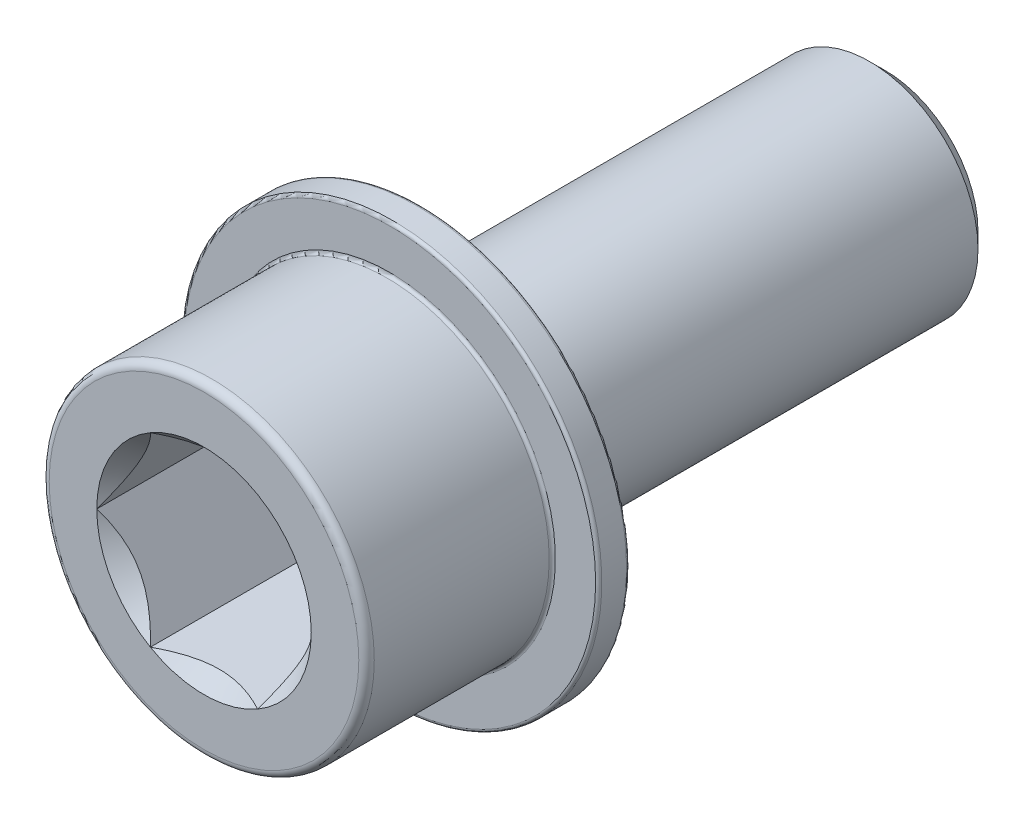
ISO-10303-21;
HEADER;
FILE_DESCRIPTION(('STEP AP214'),'2;1');
FILE_NAME('part.step','',(''),(''),'','','');
FILE_SCHEMA(('AUTOMOTIVE_DESIGN { 1 0 10303 214 1 1 1 1 }'));
ENDSEC;
DATA;
#1=APPLICATION_CONTEXT('core data for automotive mechanical design processes');
#2=APPLICATION_PROTOCOL_DEFINITION('international standard','automotive_design',2000,#1);
#3=PRODUCT_CONTEXT('',#1,'mechanical');
#4=PRODUCT('Part','Part','',(#3));
#5=PRODUCT_RELATED_PRODUCT_CATEGORY('part','',(#4));
#6=PRODUCT_DEFINITION_FORMATION('','',#4);
#7=PRODUCT_DEFINITION_CONTEXT('part definition',#1,'design');
#8=PRODUCT_DEFINITION('design','',#6,#7);
#9=PRODUCT_DEFINITION_SHAPE('','',#8);
#10=(LENGTH_UNIT() NAMED_UNIT(*) SI_UNIT(.MILLI.,.METRE.));
#11=(NAMED_UNIT(*) PLANE_ANGLE_UNIT() SI_UNIT($,.RADIAN.));
#12=(NAMED_UNIT(*) SI_UNIT($,.STERADIAN.) SOLID_ANGLE_UNIT());
#13=UNCERTAINTY_MEASURE_WITH_UNIT(LENGTH_MEASURE(1.E-05),#10,'distance_accuracy_value','');
#14=(GEOMETRIC_REPRESENTATION_CONTEXT(3) GLOBAL_UNCERTAINTY_ASSIGNED_CONTEXT((#13)) GLOBAL_UNIT_ASSIGNED_CONTEXT((#10,
#11,#12)) REPRESENTATION_CONTEXT('',''));
#15=CARTESIAN_POINT('',(0.,0.,0.));
#16=DIRECTION('',(0.,0.,1.));
#17=DIRECTION('',(1.,0.,0.));
#18=AXIS2_PLACEMENT_3D('',#15,#16,#17);
#19=CARTESIAN_POINT('',(0.,0.,44.));
#20=DIRECTION('',(0.,0.,-1.));
#21=DIRECTION('',(-1.,0.,0.));
#22=AXIS2_PLACEMENT_3D('',#19,#20,#21);
#23=CYLINDRICAL_SURFACE('',#22,10.5);
#24=CARTESIAN_POINT('',(0.,0.,32.2));
#25=DIRECTION('',(0.,0.,-1.));
#26=DIRECTION('',(-1.,0.,0.));
#27=AXIS2_PLACEMENT_3D('',#24,#25,#26);
#28=CIRCLE('',#27,10.5);
#29=CARTESIAN_POINT('',(-10.5,0.,32.2));
#30=VERTEX_POINT('',#29);
#31=EDGE_CURVE('E11',#30,#30,#28,.F.);
#32=ORIENTED_EDGE('',*,*,#31,.T.);
#33=EDGE_LOOP('',(#32));
#34=FACE_BOUND('',#33,.T.);
#35=CARTESIAN_POINT('',(0.,0.,43.5));
#36=DIRECTION('',(0.,0.,1.));
#37=DIRECTION('',(1.,0.,0.));
#38=AXIS2_PLACEMENT_3D('',#35,#36,#37);
#39=CIRCLE('',#38,10.5);
#40=CARTESIAN_POINT('',(10.5,0.,43.5));
#41=VERTEX_POINT('',#40);
#42=EDGE_CURVE('E275',#41,#41,#39,.F.);
#43=ORIENTED_EDGE('',*,*,#42,.T.);
#44=EDGE_LOOP('',(#43));
#45=FACE_BOUND('',#44,.T.);
#46=ADVANCED_FACE('F41',(#34,#45),#23,.T.);
#47=CARTESIAN_POINT('',(0.,0.,44.));
#48=DIRECTION('',(0.,0.,1.));
#49=DIRECTION('',(1.,0.,0.));
#50=AXIS2_PLACEMENT_3D('',#47,#48,#49);
#51=PLANE('',#50);
#52=CARTESIAN_POINT('',(0.,0.,44.));
#53=DIRECTION('',(0.,0.,1.));
#54=DIRECTION('',(1.,0.,0.));
#55=AXIS2_PLACEMENT_3D('',#52,#53,#54);
#56=CIRCLE('',#55,10.);
#57=CARTESIAN_POINT('',(10.,0.,44.));
#58=VERTEX_POINT('',#57);
#59=EDGE_CURVE('E117',#58,#58,#56,.T.);
#60=ORIENTED_EDGE('',*,*,#59,.T.);
#61=EDGE_LOOP('',(#60));
#62=FACE_BOUND('',#61,.T.);
#63=CARTESIAN_POINT('',(0.,0.,44.));
#64=DIRECTION('',(0.,0.,1.));
#65=DIRECTION('',(1.,0.,0.));
#66=AXIS2_PLACEMENT_3D('',#63,#64,#65);
#67=CIRCLE('',#66,6.92820323027551);
#68=CARTESIAN_POINT('',(6.92820323027551,0.,44.));
#69=VERTEX_POINT('',#68);
#70=CARTESIAN_POINT('',(3.46410161513776,6.,44.));
#71=VERTEX_POINT('',#70);
#72=EDGE_CURVE('E96',#69,#71,#67,.T.);
#73=ORIENTED_EDGE('',*,*,#72,.F.);
#74=CARTESIAN_POINT('',(3.46410161513776,-6.,44.));
#75=VERTEX_POINT('',#74);
#76=EDGE_CURVE('E56',#75,#69,#67,.T.);
#77=ORIENTED_EDGE('',*,*,#76,.F.);
#78=CARTESIAN_POINT('',(-3.46410161513775,-6.00000000000001,44.));
#79=VERTEX_POINT('',#78);
#80=EDGE_CURVE('E360',#79,#75,#67,.T.);
#81=ORIENTED_EDGE('',*,*,#80,.F.);
#82=CARTESIAN_POINT('',(-6.92820323027551,0.,44.));
#83=VERTEX_POINT('',#82);
#84=EDGE_CURVE('E63',#83,#79,#67,.T.);
#85=ORIENTED_EDGE('',*,*,#84,.F.);
#86=CARTESIAN_POINT('',(-3.46410161513776,6.,44.));
#87=VERTEX_POINT('',#86);
#88=EDGE_CURVE('E141',#87,#83,#67,.T.);
#89=ORIENTED_EDGE('',*,*,#88,.F.);
#90=EDGE_CURVE('E106',#71,#87,#67,.T.);
#91=ORIENTED_EDGE('',*,*,#90,.F.);
#92=EDGE_LOOP('',(#73,#77,#81,#85,#89,#91));
#93=FACE_BOUND('',#92,.T.);
#94=ADVANCED_FACE('F140',(#62,#93),#51,.T.);
#95=CARTESIAN_POINT('',(0.,0.,44.));
#96=DIRECTION('',(0.,0.,1.));
#97=DIRECTION('',(1.,0.,0.));
#98=AXIS2_PLACEMENT_3D('',#95,#96,#97);
#99=CONICAL_SURFACE('',#98,6.92820323027551,0.750491578357562);
#100=ORIENTED_EDGE('',*,*,#90,.T.);
#101=CARTESIAN_POINT('',(-7.05260825306782,6.,46.500064310663));
#102=CARTESIAN_POINT('',(-6.88410738071709,6.,46.3624679576523));
#103=CARTESIAN_POINT('',(-6.71461227481478,6.,46.2260697200645));
#104=CARTESIAN_POINT('',(-6.37322703107395,6.,45.956215573069));
#105=CARTESIAN_POINT('',(-6.20133628503716,6.,45.8227604339011));
#106=CARTESIAN_POINT('',(-5.85341373309508,6.,45.5583263560616));
#107=CARTESIAN_POINT('',(-5.67735948566911,6.,45.4273768474296));
#108=CARTESIAN_POINT('',(-5.32204814363578,6.,45.1699150332348));
#109=CARTESIAN_POINT('',(-5.142791308098,6.,45.0434023711896));
#110=CARTESIAN_POINT('',(-4.77199315079566,6.,44.7900001008519));
#111=CARTESIAN_POINT('',(-4.58027104411482,6.,44.6633737692706));
#112=CARTESIAN_POINT('',(-4.19198557159951,6.,44.4176426682674));
#113=CARTESIAN_POINT('',(-3.99542131207342,6.,44.2985393019993));
#114=CARTESIAN_POINT('',(-3.59740686152155,6.,44.0703364947984));
#115=CARTESIAN_POINT('',(-3.39597527120033,6.,43.9612048374504));
#116=CARTESIAN_POINT('',(-2.98696934327158,6.,43.7552349305462));
#117=CARTESIAN_POINT('',(-2.77939834456103,6.,43.6583901450731));
#118=CARTESIAN_POINT('',(-2.41717208966331,6.,43.5055280342766));
#119=CARTESIAN_POINT('',(-2.26412745169651,6.,43.4457044444064));
#120=CARTESIAN_POINT('',(-1.95457381517355,6.,43.3356083735893));
#121=CARTESIAN_POINT('',(-1.79806419135356,6.,43.2853376324193));
#122=CARTESIAN_POINT('',(-1.48326599677514,6.,43.196335365465));
#123=CARTESIAN_POINT('',(-1.32500555163963,6.,43.1575053656444));
#124=CARTESIAN_POINT('',(-1.00592489678301,6.,43.0922627279434));
#125=CARTESIAN_POINT('',(-0.845104840781636,6.,43.0658493472591));
#126=CARTESIAN_POINT('',(-0.517642942584991,6.,43.0261100964745));
#127=CARTESIAN_POINT('',(-0.350957555096316,6.,43.0131371584618));
#128=CARTESIAN_POINT('',(-0.0170983579517979,6.,43.0021620753469));
#129=CARTESIAN_POINT('',(0.150075422990053,6.,43.0041590671487));
#130=CARTESIAN_POINT('',(0.483803721413376,6.,43.0230295855054));
#131=CARTESIAN_POINT('',(0.650357060020287,6.,43.0399237193433));
#132=CARTESIAN_POINT('',(0.981428613551307,6.,43.0877550396851));
#133=CARTESIAN_POINT('',(1.1459464335119,6.,43.118694908992));
#134=CARTESIAN_POINT('',(1.5345692171745,6.,43.207530814489));
#135=CARTESIAN_POINT('',(1.75735192935873,6.,43.271213070651));
#136=CARTESIAN_POINT('',(2.19621663472209,6.,43.4184575120875));
#137=CARTESIAN_POINT('',(2.41229476732169,6.,43.5020309193224));
#138=CARTESIAN_POINT('',(2.84030671213792,6.,43.6859962966257));
#139=CARTESIAN_POINT('',(3.05215465318187,6.,43.7865859104909));
#140=CARTESIAN_POINT('',(3.36502333604018,6.,43.9467969882111));
#141=CARTESIAN_POINT('',(3.46848382272552,6.,44.0017481186883));
#142=CARTESIAN_POINT('',(3.67389083808554,6.,44.1144081982163));
#143=CARTESIAN_POINT('',(3.77583740869769,6.,44.1721170706865));
#144=CARTESIAN_POINT('',(4.07460857061895,6.,44.3459994280699));
#145=CARTESIAN_POINT('',(4.26945427871937,6.,44.4655770155437));
#146=CARTESIAN_POINT('',(4.6545192252421,6.,44.7119924856302));
#147=CARTESIAN_POINT('',(4.84473743357491,6.,44.8388319640576));
#148=CARTESIAN_POINT('',(5.22134378105732,6.,45.098379935356));
#149=CARTESIAN_POINT('',(5.40772863866273,6.,45.2310931732749));
#150=CARTESIAN_POINT('',(5.77707881342729,6.,45.5011508487114));
#151=CARTESIAN_POINT('',(5.9600443794305,6.,45.6384949471552));
#152=CARTESIAN_POINT('',(6.32383337448073,6.,45.9175455372322));
#153=CARTESIAN_POINT('',(6.50464457656916,6.,46.0592679303218));
#154=CARTESIAN_POINT('',(6.86376235144217,6.,46.3458557150934));
#155=CARTESIAN_POINT('',(7.04206883863322,6.,46.4907212137563));
#156=CARTESIAN_POINT('',(7.57361019512297,6.,46.9290746975887));
#157=CARTESIAN_POINT('',(7.9236377105875,6.,47.2264522818948));
#158=CARTESIAN_POINT('',(8.58393292662483,6.,47.7996131920634));
#159=CARTESIAN_POINT('',(8.89478822864308,6.,48.0747244265313));
#160=CARTESIAN_POINT('',(9.51241652892404,6.,48.6295605141374));
#161=CARTESIAN_POINT('',(9.81918903381437,6.,48.9092859158757));
#162=CARTESIAN_POINT('',(10.4266809451668,6.,49.4697127443719));
#163=CARTESIAN_POINT('',(10.7274300344728,6.,49.7503820800784));
#164=CARTESIAN_POINT('',(11.3262364538057,6.,50.3144612651636));
#165=CARTESIAN_POINT('',(11.6242943058736,6.,50.5978705599604));
#166=CARTESIAN_POINT('',(11.9213275003861,6.,50.8823381875809));
#167=B_SPLINE_CURVE_WITH_KNOTS('',3,(#101,#102,#103,#104,#105,#106,#107,#108,#109,#110,#111,
#112,#113,#114,#115,#116,#117,#118,#119,#120,#121,#122,#123,#124,#125,#126,#127,#128,#129,#130,
#131,#132,#133,#134,#135,#136,#137,#138,#139,#140,#141,#142,#143,#144,#145,#146,#147,#148,#149,
#150,#151,#152,#153,#154,#155,#156,#157,#158,#159,#160,#161,#162,#163,#164,#165,#166),
.UNSPECIFIED.,.F.,.F.,(4,2,2,2,2,2,2,2,2,2,2,2,2,2,2,2,2,2,2,2,2,2,2,2,2,2,2,2,2,2,2,2,4),(0.,
0.652644077295099,1.30545697864533,1.96364415144897,2.621778319914,3.31093192433291,
4.00021368968633,4.68718337327786,5.37378608210235,5.86648912684572,6.35928181747486,
6.84769990349733,7.3360887669878,7.837000053034,8.33788245910574,8.83945882689224,
9.34113103851085,10.0350280455007,10.7293174591503,11.4323076538193,11.7837201733095,
12.1351229399806,12.8207356426485,13.5064995926796,14.1928280186232,14.879106299928,
15.5682674108907,16.2574520155183,17.6351729151257,18.8804578388831,20.1258919031323,
21.3599832495184,22.5938298317047),.UNSPECIFIED.);
#168=EDGE_CURVE('E111',#71,#87,#167,.F.);
#169=ORIENTED_EDGE('',*,*,#168,.F.);
#170=EDGE_LOOP('',(#100,#169));
#171=FACE_BOUND('',#170,.T.);
#172=ADVANCED_FACE('F112',(#171),#99,.F.);
#173=ORIENTED_EDGE('',*,*,#88,.T.);
#174=CARTESIAN_POINT('',(-3.46398614508392,6.0002,44.0001238295683));
#175=CARTESIAN_POINT('',(-3.52009744598299,5.90301237596403,43.9399573855629));
#176=CARTESIAN_POINT('',(-3.57666226403532,5.8050392371765,43.8814794336319));
#177=CARTESIAN_POINT('',(-3.69078984914111,5.60736446122813,43.7684099974063));
#178=CARTESIAN_POINT('',(-3.7483531212787,5.50766194923592,43.7138205559649));
#179=CARTESIAN_POINT('',(-3.92324587987783,5.20473880546634,43.5561494561432));
#180=CARTESIAN_POINT('',(-4.04214444946887,4.9988004419874,43.4598587761648));
#181=CARTESIAN_POINT('',(-4.28241011901815,4.58264809501349,43.2921222903678));
#182=CARTESIAN_POINT('',(-4.40371564060358,4.37254076838889,43.220333557906));
#183=CARTESIAN_POINT('',(-4.5880280213572,4.05330236045963,43.1342263807976));
#184=CARTESIAN_POINT('',(-4.64979390598387,3.9463207101118,43.1091345478769));
#185=CARTESIAN_POINT('',(-4.77398157004797,3.73122136627948,43.0666908614491));
#186=CARTESIAN_POINT('',(-4.83640323394521,3.62310387291646,43.0493376671446));
#187=CARTESIAN_POINT('',(-4.98472534389215,3.36620244260256,43.0179951075345));
#188=CARTESIAN_POINT('',(-5.07082297085406,3.21707697829341,43.0075862080009));
#189=CARTESIAN_POINT('',(-5.2431504070134,2.91859710332736,43.0027581868921));
#190=CARTESIAN_POINT('',(-5.32938024638919,2.76924264039999,43.0083435275512));
#191=CARTESIAN_POINT('',(-5.50130187341206,2.47146564747646,43.0352055642367));
#192=CARTESIAN_POINT('',(-5.58699306511096,2.32304414969285,43.0564973176827));
#193=CARTESIAN_POINT('',(-5.75712518613232,2.02836667208439,43.11366293795));
#194=CARTESIAN_POINT('',(-5.84156620491346,1.88211053731259,43.1495357561153));
#195=CARTESIAN_POINT('',(-6.01279765973118,1.58552895771436,43.2362524981659));
#196=CARTESIAN_POINT('',(-6.09950678533143,1.43534434669485,43.2877314424009));
#197=CARTESIAN_POINT('',(-6.27091508968158,1.13845645472117,43.4028338615382));
#198=CARTESIAN_POINT('',(-6.35561313365319,0.991755139260624,43.4664640180314));
#199=CARTESIAN_POINT('',(-6.52286702916525,0.702062894469918,43.6037754142652));
#200=CARTESIAN_POINT('',(-6.60542404668413,0.559069945605882,43.6774510404833));
#201=CARTESIAN_POINT('',(-6.76840424730235,0.276779957507353,43.8330300334854));
#202=CARTESIAN_POINT('',(-6.84883096187252,0.137476801585972,43.9149185453595));
#203=CARTESIAN_POINT('',(-6.92831870032935,-0.000199999999999056,44.0001238295683));
#204=B_SPLINE_CURVE_WITH_KNOTS('',3,(#174,#175,#176,#177,#178,#179,#180,#181,#182,#183,#184,
#185,#186,#187,#188,#189,#190,#191,#192,#193,#194,#195,#196,#197,#198,#199,#200,#201,#202,#203),
.UNSPECIFIED.,.F.,.F.,(4,2,2,2,2,2,2,2,2,2,2,2,2,2,4),(0.,0.381980245869223,0.764159709580468,
1.53284358539012,2.29027966559462,2.66823072320961,3.04611627151759,3.56288885454461,
4.07980562603912,4.59721860025022,5.1145943692094,5.65676191755865,6.19922845066303,
6.74139308030419,7.2825941833133),.UNSPECIFIED.);
#205=EDGE_CURVE('E105',#87,#83,#204,.T.);
#206=ORIENTED_EDGE('',*,*,#205,.F.);
#207=EDGE_LOOP('',(#173,#206));
#208=FACE_BOUND('',#207,.T.);
#209=ADVANCED_FACE('F371',(#208),#99,.F.);
#210=ORIENTED_EDGE('',*,*,#84,.T.);
#211=CARTESIAN_POINT('',(-6.92831870032935,0.0002,44.0001238295683));
#212=CARTESIAN_POINT('',(-6.87220739943028,-0.0969876240359742,43.9399573855629));
#213=CARTESIAN_POINT('',(-6.81564258137795,-0.194960762823503,43.8814794336319));
#214=CARTESIAN_POINT('',(-6.70151499627216,-0.392635538771868,43.7684099974063));
#215=CARTESIAN_POINT('',(-6.64395172413457,-0.492338050764086,43.7138205559649));
#216=CARTESIAN_POINT('',(-6.46905896553543,-0.795261194533668,43.5561494561432));
#217=CARTESIAN_POINT('',(-6.3501603959444,-1.00119955801261,43.4598587761648));
#218=CARTESIAN_POINT('',(-6.10989472639512,-1.41735190498651,43.2921222903678));
#219=CARTESIAN_POINT('',(-5.98858920480969,-1.62745923161112,43.220333557906));
#220=CARTESIAN_POINT('',(-5.80427682405607,-1.94669763954037,43.1342263807976));
#221=CARTESIAN_POINT('',(-5.7425109394294,-2.0536792898882,43.1091345478769));
#222=CARTESIAN_POINT('',(-5.61832327536529,-2.26877863372053,43.0666908614491));
#223=CARTESIAN_POINT('',(-5.55590161146805,-2.37689612708354,43.0493376671446));
#224=CARTESIAN_POINT('',(-5.40757950152112,-2.63379755739744,43.0179951075345));
#225=CARTESIAN_POINT('',(-5.3214818745592,-2.78292302170659,43.0075862080009));
#226=CARTESIAN_POINT('',(-5.14915443839987,-3.08140289667264,43.0027581868921));
#227=CARTESIAN_POINT('',(-5.06292459902408,-3.23075735960001,43.0083435275512));
#228=CARTESIAN_POINT('',(-4.8910029720012,-3.52853435252354,43.0352055642367));
#229=CARTESIAN_POINT('',(-4.80531178030231,-3.67695585030715,43.0564973176827));
#230=CARTESIAN_POINT('',(-4.63517965928095,-3.9716333279156,43.11366293795));
#231=CARTESIAN_POINT('',(-4.55073864049981,-4.11788946268741,43.1495357561153));
#232=CARTESIAN_POINT('',(-4.37950718568209,-4.41447104228564,43.2362524981659));
#233=CARTESIAN_POINT('',(-4.29279806008183,-4.56465565330515,43.2877314424009));
#234=CARTESIAN_POINT('',(-4.12138975573168,-4.86154354527884,43.4028338615382));
#235=CARTESIAN_POINT('',(-4.03669171176007,-5.00824486073938,43.4664640180314));
#236=CARTESIAN_POINT('',(-3.86943781624801,-5.29793710553008,43.6037754142652));
#237=CARTESIAN_POINT('',(-3.78688079872914,-5.44093005439412,43.6774510404833));
#238=CARTESIAN_POINT('',(-3.62390059811092,-5.72322004249265,43.8330300334854));
#239=CARTESIAN_POINT('',(-3.54347388354074,-5.86252319841403,43.9149185453594));
#240=CARTESIAN_POINT('',(-3.46398614508391,-6.0002,44.0001238295683));
#241=B_SPLINE_CURVE_WITH_KNOTS('',3,(#211,#212,#213,#214,#215,#216,#217,#218,#219,#220,#221,
#222,#223,#224,#225,#226,#227,#228,#229,#230,#231,#232,#233,#234,#235,#236,#237,#238,#239,#240),
.UNSPECIFIED.,.F.,.F.,(4,2,2,2,2,2,2,2,2,2,2,2,2,2,4),(0.,0.381980245869222,0.764159709580467,
1.53284358539012,2.29027966559462,2.6682307232096,3.04611627151759,3.56288885454461,
4.07980562603911,4.59721860025022,5.1145943692094,5.65676191755866,6.19922845066303,
6.74139308030419,7.28259418331331),.UNSPECIFIED.);
#242=EDGE_CURVE('E154',#83,#79,#241,.T.);
#243=ORIENTED_EDGE('',*,*,#242,.F.);
#244=EDGE_LOOP('',(#210,#243));
#245=FACE_BOUND('',#244,.T.);
#246=ADVANCED_FACE('F373',(#245),#99,.F.);
#247=ORIENTED_EDGE('',*,*,#80,.T.);
#248=CARTESIAN_POINT('',(-7.05260825306782,-6.,46.500064310663));
#249=CARTESIAN_POINT('',(-6.88410738071709,-6.,46.3624679576523));
#250=CARTESIAN_POINT('',(-6.71461227481478,-6.,46.2260697200645));
#251=CARTESIAN_POINT('',(-6.37322703107395,-6.,45.956215573069));
#252=CARTESIAN_POINT('',(-6.20133628503716,-6.,45.8227604339011));
#253=CARTESIAN_POINT('',(-5.85341373309508,-6.,45.5583263560616));
#254=CARTESIAN_POINT('',(-5.67735948566911,-6.,45.4273768474296));
#255=CARTESIAN_POINT('',(-5.32204814363577,-6.,45.1699150332348));
#256=CARTESIAN_POINT('',(-5.142791308098,-6.,45.0434023711896));
#257=CARTESIAN_POINT('',(-4.77199315079566,-6.,44.7900001008519));
#258=CARTESIAN_POINT('',(-4.58027104411482,-6.,44.6633737692706));
#259=CARTESIAN_POINT('',(-4.19198557159951,-6.,44.4176426682674));
#260=CARTESIAN_POINT('',(-3.99542131207341,-6.,44.2985393019993));
#261=CARTESIAN_POINT('',(-3.59740686152154,-6.,44.0703364947984));
#262=CARTESIAN_POINT('',(-3.39597527120032,-6.,43.9612048374504));
#263=CARTESIAN_POINT('',(-2.98696934327157,-6.,43.7552349305462));
#264=CARTESIAN_POINT('',(-2.77939834456102,-6.,43.6583901450731));
#265=CARTESIAN_POINT('',(-2.4171720896633,-6.,43.5055280342766));
#266=CARTESIAN_POINT('',(-2.26412745169651,-6.,43.4457044444064));
#267=CARTESIAN_POINT('',(-1.95457381517355,-6.,43.3356083735893));
#268=CARTESIAN_POINT('',(-1.79806419135355,-6.,43.2853376324193));
#269=CARTESIAN_POINT('',(-1.48326599677514,-6.,43.196335365465));
#270=CARTESIAN_POINT('',(-1.32500555163963,-6.,43.1575053656444));
#271=CARTESIAN_POINT('',(-1.005924896783,-6.,43.0922627279434));
#272=CARTESIAN_POINT('',(-0.845104840781635,-6.,43.0658493472591));
#273=CARTESIAN_POINT('',(-0.517642942584988,-6.,43.0261100964745));
#274=CARTESIAN_POINT('',(-0.350957555096314,-6.,43.0131371584618));
#275=CARTESIAN_POINT('',(-0.0170983579517952,-6.,43.0021620753469));
#276=CARTESIAN_POINT('',(0.150075422990056,-6.,43.0041590671487));
#277=CARTESIAN_POINT('',(0.483803721413379,-6.,43.0230295855054));
#278=CARTESIAN_POINT('',(0.65035706002029,-6.,43.0399237193433));
#279=CARTESIAN_POINT('',(0.98142861355131,-6.,43.0877550396851));
#280=CARTESIAN_POINT('',(1.1459464335119,-6.,43.118694908992));
#281=CARTESIAN_POINT('',(1.5345692171745,-6.,43.207530814489));
#282=CARTESIAN_POINT('',(1.75735192935873,-6.,43.271213070651));
#283=CARTESIAN_POINT('',(2.19621663472209,-6.,43.4184575120875));
#284=CARTESIAN_POINT('',(2.41229476732169,-6.,43.5020309193224));
#285=CARTESIAN_POINT('',(2.84030671213792,-6.,43.6859962966257));
#286=CARTESIAN_POINT('',(3.05215465318187,-6.,43.7865859104909));
#287=CARTESIAN_POINT('',(3.36502333604018,-6.,43.9467969882111));
#288=CARTESIAN_POINT('',(3.46848382272552,-6.,44.0017481186883));
#289=CARTESIAN_POINT('',(3.67389083808554,-6.,44.1144081982163));
#290=CARTESIAN_POINT('',(3.7758374086977,-6.,44.1721170706865));
#291=CARTESIAN_POINT('',(4.07460857061895,-6.,44.3459994280699));
#292=CARTESIAN_POINT('',(4.26945427871936,-6.,44.4655770155437));
#293=CARTESIAN_POINT('',(4.65451922524209,-6.,44.7119924856302));
#294=CARTESIAN_POINT('',(4.8447374335749,-6.,44.8388319640576));
#295=CARTESIAN_POINT('',(5.22134378105731,-6.,45.098379935356));
#296=CARTESIAN_POINT('',(5.40772863866272,-6.,45.2310931732749));
#297=CARTESIAN_POINT('',(5.77707881342727,-6.,45.5011508487114));
#298=CARTESIAN_POINT('',(5.96004437943049,-6.,45.6384949471551));
#299=CARTESIAN_POINT('',(6.32383337448072,-6.,45.9175455372322));
#300=CARTESIAN_POINT('',(6.50464457656915,-6.,46.0592679303218));
#301=CARTESIAN_POINT('',(6.86376235144216,-6.,46.3458557150934));
#302=CARTESIAN_POINT('',(7.04206883863321,-6.,46.4907212137562));
#303=CARTESIAN_POINT('',(7.57361019512296,-6.,46.9290746975887));
#304=CARTESIAN_POINT('',(7.92363771058749,-6.,47.2264522818947));
#305=CARTESIAN_POINT('',(8.58393292662482,-6.,47.7996131920634));
#306=CARTESIAN_POINT('',(8.89478822864306,-6.,48.0747244265313));
#307=CARTESIAN_POINT('',(9.51241652892402,-6.,48.6295605141374));
#308=CARTESIAN_POINT('',(9.81918903381436,-6.,48.9092859158757));
#309=CARTESIAN_POINT('',(10.4266809451668,-6.,49.4697127443719));
#310=CARTESIAN_POINT('',(10.7274300344728,-6.,49.7503820800784));
#311=CARTESIAN_POINT('',(11.3262364538057,-6.,50.3144612651636));
#312=CARTESIAN_POINT('',(11.6242943058736,-6.,50.5978705599604));
#313=CARTESIAN_POINT('',(11.9213275003861,-6.,50.8823381875809));
#314=B_SPLINE_CURVE_WITH_KNOTS('',3,(#248,#249,#250,#251,#252,#253,#254,#255,#256,#257,#258,
#259,#260,#261,#262,#263,#264,#265,#266,#267,#268,#269,#270,#271,#272,#273,#274,#275,#276,#277,
#278,#279,#280,#281,#282,#283,#284,#285,#286,#287,#288,#289,#290,#291,#292,#293,#294,#295,#296,
#297,#298,#299,#300,#301,#302,#303,#304,#305,#306,#307,#308,#309,#310,#311,#312,#313),
.UNSPECIFIED.,.F.,.F.,(4,2,2,2,2,2,2,2,2,2,2,2,2,2,2,2,2,2,2,2,2,2,2,2,2,2,2,2,2,2,2,2,4),(0.,
0.652644077295099,1.30545697864533,1.96364415144897,2.621778319914,3.31093192433292,
4.00021368968634,4.68718337327787,5.37378608210236,5.86648912684573,6.35928181747486,
6.84769990349733,7.33608876698781,7.83700005303401,8.33788245910575,8.83945882689224,
9.34113103851085,10.0350280455007,10.7293174591503,11.4323076538193,11.7837201733095,
12.1351229399806,12.8207356426485,13.5064995926796,14.1928280186232,14.8791062999279,
15.5682674108907,16.2574520155182,17.6351729151257,18.8804578388831,20.1258919031323,
21.3599832495184,22.5938298317047),.UNSPECIFIED.);
#315=EDGE_CURVE('E184',#79,#75,#314,.T.);
#316=ORIENTED_EDGE('',*,*,#315,.F.);
#317=EDGE_LOOP('',(#247,#316));
#318=FACE_BOUND('',#317,.T.);
#319=ADVANCED_FACE('F361',(#318),#99,.F.);
#320=ORIENTED_EDGE('',*,*,#76,.T.);
#321=CARTESIAN_POINT('',(3.46398614508392,-6.0002,44.0001238295683));
#322=CARTESIAN_POINT('',(3.52009744598299,-5.90301237596403,43.9399573855629));
#323=CARTESIAN_POINT('',(3.57666226403532,-5.8050392371765,43.8814794336319));
#324=CARTESIAN_POINT('',(3.69078984914111,-5.60736446122814,43.7684099974063));
#325=CARTESIAN_POINT('',(3.7483531212787,-5.50766194923592,43.7138205559649));
#326=CARTESIAN_POINT('',(3.92324587987783,-5.20473880546634,43.5561494561432));
#327=CARTESIAN_POINT('',(4.04214444946887,-4.9988004419874,43.4598587761648));
#328=CARTESIAN_POINT('',(4.28241011901815,-4.58264809501349,43.2921222903678));
#329=CARTESIAN_POINT('',(4.40371564060358,-4.37254076838889,43.220333557906));
#330=CARTESIAN_POINT('',(4.5880280213572,-4.05330236045963,43.1342263807976));
#331=CARTESIAN_POINT('',(4.64979390598387,-3.94632071011181,43.1091345478769));
#332=CARTESIAN_POINT('',(4.77398157004797,-3.73122136627948,43.0666908614491));
#333=CARTESIAN_POINT('',(4.83640323394521,-3.62310387291647,43.0493376671446));
#334=CARTESIAN_POINT('',(4.98472534389215,-3.36620244260256,43.0179951075345));
#335=CARTESIAN_POINT('',(5.07082297085406,-3.21707697829341,43.0075862080009));
#336=CARTESIAN_POINT('',(5.2431504070134,-2.91859710332736,43.0027581868921));
#337=CARTESIAN_POINT('',(5.32938024638919,-2.7692426404,43.0083435275512));
#338=CARTESIAN_POINT('',(5.50130187341206,-2.47146564747647,43.0352055642367));
#339=CARTESIAN_POINT('',(5.58699306511096,-2.32304414969285,43.0564973176827));
#340=CARTESIAN_POINT('',(5.75712518613232,-2.0283666720844,43.11366293795));
#341=CARTESIAN_POINT('',(5.84156620491346,-1.88211053731259,43.1495357561153));
#342=CARTESIAN_POINT('',(6.01279765973118,-1.58552895771436,43.236252498166));
#343=CARTESIAN_POINT('',(6.09950678533143,-1.43534434669485,43.2877314424009));
#344=CARTESIAN_POINT('',(6.27091508968158,-1.13845645472117,43.4028338615382));
#345=CARTESIAN_POINT('',(6.3556131336532,-0.991755139260624,43.4664640180314));
#346=CARTESIAN_POINT('',(6.52286702916526,-0.702062894469919,43.6037754142652));
#347=CARTESIAN_POINT('',(6.60542404668413,-0.559069945605884,43.6774510404833));
#348=CARTESIAN_POINT('',(6.76840424730235,-0.276779957507354,43.8330300334854));
#349=CARTESIAN_POINT('',(6.84883096187252,-0.137476801585972,43.9149185453595));
#350=CARTESIAN_POINT('',(6.92831870032935,0.000199999999999219,44.0001238295683));
#351=B_SPLINE_CURVE_WITH_KNOTS('',3,(#321,#322,#323,#324,#325,#326,#327,#328,#329,#330,#331,
#332,#333,#334,#335,#336,#337,#338,#339,#340,#341,#342,#343,#344,#345,#346,#347,#348,#349,#350),
.UNSPECIFIED.,.F.,.F.,(4,2,2,2,2,2,2,2,2,2,2,2,2,2,4),(0.,0.381980245869219,0.764159709580462,
1.53284358539012,2.29027966559462,2.6682307232096,3.04611627151758,3.5628888545446,
4.07980562603911,4.59721860025022,5.1145943692094,5.65676191755865,6.19922845066303,
6.74139308030419,7.2825941833133),.UNSPECIFIED.);
#352=EDGE_CURVE('E129',#75,#69,#351,.T.);
#353=ORIENTED_EDGE('',*,*,#352,.F.);
#354=EDGE_LOOP('',(#320,#353));
#355=FACE_BOUND('',#354,.T.);
#356=ADVANCED_FACE('F169',(#355),#99,.F.);
#357=ORIENTED_EDGE('',*,*,#72,.T.);
#358=CARTESIAN_POINT('',(6.92831870032935,-0.000199999999998108,44.0001238295683));
#359=CARTESIAN_POINT('',(6.87220739943028,0.0969876240359769,43.9399573855629));
#360=CARTESIAN_POINT('',(6.81564258137795,0.194960762823506,43.8814794336319));
#361=CARTESIAN_POINT('',(6.70151499627216,0.392635538771872,43.7684099974063));
#362=CARTESIAN_POINT('',(6.64395172413457,0.492338050764089,43.7138205559649));
#363=CARTESIAN_POINT('',(6.46905896553544,0.795261194533671,43.5561494561432));
#364=CARTESIAN_POINT('',(6.3501603959444,1.00119955801261,43.4598587761648));
#365=CARTESIAN_POINT('',(6.10989472639512,1.41735190498652,43.2921222903678));
#366=CARTESIAN_POINT('',(5.98858920480969,1.62745923161112,43.220333557906));
#367=CARTESIAN_POINT('',(5.80427682405607,1.94669763954037,43.1342263807976));
#368=CARTESIAN_POINT('',(5.7425109394294,2.0536792898882,43.1091345478769));
#369=CARTESIAN_POINT('',(5.6183232753653,2.26877863372052,43.0666908614491));
#370=CARTESIAN_POINT('',(5.55590161146806,2.37689612708354,43.0493376671446));
#371=CARTESIAN_POINT('',(5.40757950152112,2.63379755739744,43.0179951075345));
#372=CARTESIAN_POINT('',(5.3214818745592,2.78292302170659,43.0075862080009));
#373=CARTESIAN_POINT('',(5.14915443839987,3.08140289667264,43.0027581868921));
#374=CARTESIAN_POINT('',(5.06292459902408,3.23075735960001,43.0083435275512));
#375=CARTESIAN_POINT('',(4.89100297200121,3.52853435252354,43.0352055642367));
#376=CARTESIAN_POINT('',(4.80531178030231,3.67695585030715,43.0564973176827));
#377=CARTESIAN_POINT('',(4.63517965928095,3.9716333279156,43.11366293795));
#378=CARTESIAN_POINT('',(4.55073864049981,4.11788946268741,43.1495357561153));
#379=CARTESIAN_POINT('',(4.37950718568209,4.41447104228564,43.236252498166));
#380=CARTESIAN_POINT('',(4.29279806008184,4.56465565330515,43.2877314424009));
#381=CARTESIAN_POINT('',(4.12138975573169,4.86154354527884,43.4028338615382));
#382=CARTESIAN_POINT('',(4.03669171176007,5.00824486073938,43.4664640180314));
#383=CARTESIAN_POINT('',(3.86943781624801,5.29793710553009,43.6037754142652));
#384=CARTESIAN_POINT('',(3.78688079872914,5.44093005439412,43.6774510404833));
#385=CARTESIAN_POINT('',(3.62390059811092,5.72322004249265,43.8330300334854));
#386=CARTESIAN_POINT('',(3.54347388354074,5.86252319841404,43.9149185453595));
#387=CARTESIAN_POINT('',(3.46398614508392,6.0002,44.0001238295683));
#388=B_SPLINE_CURVE_WITH_KNOTS('',3,(#358,#359,#360,#361,#362,#363,#364,#365,#366,#367,#368,
#369,#370,#371,#372,#373,#374,#375,#376,#377,#378,#379,#380,#381,#382,#383,#384,#385,#386,#387),
.UNSPECIFIED.,.F.,.F.,(4,2,2,2,2,2,2,2,2,2,2,2,2,2,4),(0.,0.381980245869223,0.764159709580469,
1.53284358539012,2.29027966559462,2.6682307232096,3.04611627151758,3.5628888545446,
4.07980562603911,4.59721860025022,5.11459436920939,5.65676191755865,6.19922845066303,
6.74139308030419,7.2825941833133),.UNSPECIFIED.);
#389=EDGE_CURVE('E100',#69,#71,#388,.T.);
#390=ORIENTED_EDGE('',*,*,#389,.F.);
#391=EDGE_LOOP('',(#357,#390));
#392=FACE_BOUND('',#391,.T.);
#393=ADVANCED_FACE('F98',(#392),#99,.F.);
#394=CARTESIAN_POINT('',(0.,0.,34.));
#395=DIRECTION('',(0.,0.,1.));
#396=DIRECTION('',(1.,0.,0.));
#397=AXIS2_PLACEMENT_3D('',#394,#395,#396);
#398=PLANE('',#397);
#399=DIRECTION('',(-0.5,0.866025403784439,0.));
#400=VECTOR('',#399,1.);
#401=CARTESIAN_POINT('',(6.92820323027551,0.,34.));
#402=LINE('',#401,#400);
#403=CARTESIAN_POINT('',(6.92820323027551,0.,34.));
#404=VERTEX_POINT('',#403);
#405=CARTESIAN_POINT('',(3.46410161513776,6.,34.));
#406=VERTEX_POINT('',#405);
#407=EDGE_CURVE('E128',#404,#406,#402,.T.);
#408=ORIENTED_EDGE('',*,*,#407,.T.);
#409=DIRECTION('',(-1.,0.,0.));
#410=VECTOR('',#409,1.);
#411=CARTESIAN_POINT('',(3.46410161513776,6.,34.));
#412=LINE('',#411,#410);
#413=CARTESIAN_POINT('',(-3.46410161513775,6.,34.));
#414=VERTEX_POINT('',#413);
#415=EDGE_CURVE('E133',#406,#414,#412,.T.);
#416=ORIENTED_EDGE('',*,*,#415,.T.);
#417=DIRECTION('',(-0.5,-0.866025403784439,0.));
#418=VECTOR('',#417,1.);
#419=CARTESIAN_POINT('',(-3.46410161513775,6.,34.));
#420=LINE('',#419,#418);
#421=CARTESIAN_POINT('',(-6.92820323027551,0.,34.));
#422=VERTEX_POINT('',#421);
#423=EDGE_CURVE('E347',#414,#422,#420,.T.);
#424=ORIENTED_EDGE('',*,*,#423,.T.);
#425=DIRECTION('',(0.5,-0.866025403784439,0.));
#426=VECTOR('',#425,1.);
#427=CARTESIAN_POINT('',(-6.92820323027551,0.,34.));
#428=LINE('',#427,#426);
#429=CARTESIAN_POINT('',(-3.46410161513775,-6.,34.));
#430=VERTEX_POINT('',#429);
#431=EDGE_CURVE('E343',#422,#430,#428,.T.);
#432=ORIENTED_EDGE('',*,*,#431,.T.);
#433=DIRECTION('',(1.,0.,0.));
#434=VECTOR('',#433,1.);
#435=CARTESIAN_POINT('',(-3.46410161513775,-6.,34.));
#436=LINE('',#435,#434);
#437=CARTESIAN_POINT('',(3.46410161513776,-6.,34.));
#438=VERTEX_POINT('',#437);
#439=EDGE_CURVE('E339',#430,#438,#436,.T.);
#440=ORIENTED_EDGE('',*,*,#439,.T.);
#441=DIRECTION('',(0.5,0.866025403784439,0.));
#442=VECTOR('',#441,1.);
#443=CARTESIAN_POINT('',(3.46410161513776,-6.,34.));
#444=LINE('',#443,#442);
#445=EDGE_CURVE('E137',#438,#404,#444,.T.);
#446=ORIENTED_EDGE('',*,*,#445,.T.);
#447=EDGE_LOOP('',(#408,#416,#424,#432,#440,#446));
#448=FACE_BOUND('',#447,.T.);
#449=ADVANCED_FACE('F168',(#448),#398,.T.);
#450=CARTESIAN_POINT('',(3.46410161513776,6.,34.));
#451=DIRECTION('',(0.,1.,0.));
#452=DIRECTION('',(0.,0.,1.));
#453=AXIS2_PLACEMENT_3D('',#450,#451,#452);
#454=PLANE('',#453);
#455=DIRECTION('',(0.,0.,1.));
#456=VECTOR('',#455,1.);
#457=CARTESIAN_POINT('',(3.46410161513776,6.,34.));
#458=LINE('',#457,#456);
#459=EDGE_CURVE('E124',#406,#71,#458,.T.);
#460=ORIENTED_EDGE('',*,*,#459,.T.);
#461=ORIENTED_EDGE('',*,*,#168,.T.);
#462=DIRECTION('',(0.,0.,1.));
#463=VECTOR('',#462,1.);
#464=CARTESIAN_POINT('',(-3.46410161513775,6.,34.));
#465=LINE('',#464,#463);
#466=EDGE_CURVE('E136',#414,#87,#465,.T.);
#467=ORIENTED_EDGE('',*,*,#466,.F.);
#468=ORIENTED_EDGE('',*,*,#415,.F.);
#469=EDGE_LOOP('',(#460,#461,#467,#468));
#470=FACE_BOUND('',#469,.T.);
#471=ADVANCED_FACE('F131',(#470),#454,.F.);
#472=CARTESIAN_POINT('',(-3.46410161513775,6.,34.));
#473=DIRECTION('',(-0.866025403784439,0.5,0.));
#474=DIRECTION('',(-0.5,-0.866025403784439,0.));
#475=AXIS2_PLACEMENT_3D('',#472,#473,#474);
#476=PLANE('',#475);
#477=ORIENTED_EDGE('',*,*,#466,.T.);
#478=ORIENTED_EDGE('',*,*,#205,.T.);
#479=DIRECTION('',(0.,0.,1.));
#480=VECTOR('',#479,1.);
#481=CARTESIAN_POINT('',(-6.92820323027551,0.,34.));
#482=LINE('',#481,#480);
#483=EDGE_CURVE('E327',#422,#83,#482,.T.);
#484=ORIENTED_EDGE('',*,*,#483,.F.);
#485=ORIENTED_EDGE('',*,*,#423,.F.);
#486=EDGE_LOOP('',(#477,#478,#484,#485));
#487=FACE_BOUND('',#486,.T.);
#488=ADVANCED_FACE('F161',(#487),#476,.F.);
#489=CARTESIAN_POINT('',(-6.92820323027551,0.,34.));
#490=DIRECTION('',(-0.866025403784438,-0.5,0.));
#491=DIRECTION('',(0.5,-0.866025403784439,0.));
#492=AXIS2_PLACEMENT_3D('',#489,#490,#491);
#493=PLANE('',#492);
#494=ORIENTED_EDGE('',*,*,#483,.T.);
#495=ORIENTED_EDGE('',*,*,#242,.T.);
#496=DIRECTION('',(0.,0.,1.));
#497=VECTOR('',#496,1.);
#498=CARTESIAN_POINT('',(-3.46410161513775,-6.,34.));
#499=LINE('',#498,#497);
#500=EDGE_CURVE('E330',#430,#79,#499,.T.);
#501=ORIENTED_EDGE('',*,*,#500,.F.);
#502=ORIENTED_EDGE('',*,*,#431,.F.);
#503=EDGE_LOOP('',(#494,#495,#501,#502));
#504=FACE_BOUND('',#503,.T.);
#505=ADVANCED_FACE('F209',(#504),#493,.F.);
#506=CARTESIAN_POINT('',(-3.46410161513775,-6.,34.));
#507=DIRECTION('',(0.,-1.,0.));
#508=DIRECTION('',(0.,0.,-1.));
#509=AXIS2_PLACEMENT_3D('',#506,#507,#508);
#510=PLANE('',#509);
#511=ORIENTED_EDGE('',*,*,#500,.T.);
#512=ORIENTED_EDGE('',*,*,#315,.T.);
#513=DIRECTION('',(0.,0.,1.));
#514=VECTOR('',#513,1.);
#515=CARTESIAN_POINT('',(3.46410161513776,-6.,34.));
#516=LINE('',#515,#514);
#517=EDGE_CURVE('E310',#438,#75,#516,.T.);
#518=ORIENTED_EDGE('',*,*,#517,.F.);
#519=ORIENTED_EDGE('',*,*,#439,.F.);
#520=EDGE_LOOP('',(#511,#512,#518,#519));
#521=FACE_BOUND('',#520,.T.);
#522=ADVANCED_FACE('F205',(#521),#510,.F.);
#523=CARTESIAN_POINT('',(3.46410161513776,-6.,34.));
#524=DIRECTION('',(0.866025403784439,-0.5,0.));
#525=DIRECTION('',(0.5,0.866025403784439,0.));
#526=AXIS2_PLACEMENT_3D('',#523,#524,#525);
#527=PLANE('',#526);
#528=ORIENTED_EDGE('',*,*,#517,.T.);
#529=ORIENTED_EDGE('',*,*,#352,.T.);
#530=DIRECTION('',(0.,0.,1.));
#531=VECTOR('',#530,1.);
#532=CARTESIAN_POINT('',(6.92820323027551,0.,34.));
#533=LINE('',#532,#531);
#534=EDGE_CURVE('E126',#404,#69,#533,.T.);
#535=ORIENTED_EDGE('',*,*,#534,.F.);
#536=ORIENTED_EDGE('',*,*,#445,.F.);
#537=EDGE_LOOP('',(#528,#529,#535,#536));
#538=FACE_BOUND('',#537,.T.);
#539=ADVANCED_FACE('F202',(#538),#527,.F.);
#540=CARTESIAN_POINT('',(6.92820323027551,0.,34.));
#541=DIRECTION('',(0.866025403784439,0.5,0.));
#542=DIRECTION('',(-0.5,0.866025403784439,0.));
#543=AXIS2_PLACEMENT_3D('',#540,#541,#542);
#544=PLANE('',#543);
#545=ORIENTED_EDGE('',*,*,#534,.T.);
#546=ORIENTED_EDGE('',*,*,#389,.T.);
#547=ORIENTED_EDGE('',*,*,#459,.F.);
#548=ORIENTED_EDGE('',*,*,#407,.F.);
#549=EDGE_LOOP('',(#545,#546,#547,#548));
#550=FACE_BOUND('',#549,.T.);
#551=ADVANCED_FACE('F122',(#550),#544,.F.);
#552=CARTESIAN_POINT('',(0.,0.,43.5));
#553=DIRECTION('',(0.,0.,1.));
#554=DIRECTION('',(1.,0.,0.));
#555=AXIS2_PLACEMENT_3D('',#552,#553,#554);
#556=TOROIDAL_SURFACE('',#555,10.,0.5);
#557=ORIENTED_EDGE('',*,*,#42,.F.);
#558=EDGE_LOOP('',(#557));
#559=FACE_BOUND('',#558,.T.);
#560=ORIENTED_EDGE('',*,*,#59,.F.);
#561=EDGE_LOOP('',(#560));
#562=FACE_BOUND('',#561,.T.);
#563=ADVANCED_FACE('F244',(#559,#562),#556,.T.);
#564=CARTESIAN_POINT('',(0.,0.,32.));
#565=DIRECTION('',(0.,0.,-1.));
#566=DIRECTION('',(-1.,0.,0.));
#567=AXIS2_PLACEMENT_3D('',#564,#565,#566);
#568=CYLINDRICAL_SURFACE('',#567,13.5);
#569=CARTESIAN_POINT('',(0.,0.,30.2));
#570=DIRECTION('',(0.,0.,1.));
#571=DIRECTION('',(1.,0.,0.));
#572=AXIS2_PLACEMENT_3D('',#569,#570,#571);
#573=CIRCLE('',#572,13.5);
#574=CARTESIAN_POINT('',(13.5,0.,30.2));
#575=VERTEX_POINT('',#574);
#576=EDGE_CURVE('E266',#575,#575,#573,.T.);
#577=ORIENTED_EDGE('',*,*,#576,.T.);
#578=EDGE_LOOP('',(#577));
#579=FACE_BOUND('',#578,.T.);
#580=CARTESIAN_POINT('',(0.,0.,31.8));
#581=DIRECTION('',(0.,0.,-1.));
#582=DIRECTION('',(-1.,0.,0.));
#583=AXIS2_PLACEMENT_3D('',#580,#581,#582);
#584=CIRCLE('',#583,13.5);
#585=CARTESIAN_POINT('',(-13.5,0.,31.8));
#586=VERTEX_POINT('',#585);
#587=EDGE_CURVE('E263',#586,#586,#584,.T.);
#588=ORIENTED_EDGE('',*,*,#587,.T.);
#589=EDGE_LOOP('',(#588));
#590=FACE_BOUND('',#589,.T.);
#591=ADVANCED_FACE('F170',(#579,#590),#568,.T.);
#592=CARTESIAN_POINT('',(0.,0.,32.));
#593=DIRECTION('',(0.,0.,-1.));
#594=DIRECTION('',(-1.,0.,0.));
#595=AXIS2_PLACEMENT_3D('',#592,#593,#594);
#596=PLANE('',#595);
#597=CARTESIAN_POINT('',(0.,0.,32.));
#598=DIRECTION('',(0.,0.,-1.));
#599=DIRECTION('',(-1.,0.,0.));
#600=AXIS2_PLACEMENT_3D('',#597,#598,#599);
#601=CIRCLE('',#600,13.3);
#602=CARTESIAN_POINT('',(-13.3,0.,32.));
#603=VERTEX_POINT('',#602);
#604=EDGE_CURVE('E50',#603,#603,#601,.F.);
#605=ORIENTED_EDGE('',*,*,#604,.T.);
#606=EDGE_LOOP('',(#605));
#607=FACE_BOUND('',#606,.T.);
#608=CARTESIAN_POINT('',(0.,0.,32.));
#609=DIRECTION('',(0.,0.,-1.));
#610=DIRECTION('',(-1.,0.,0.));
#611=AXIS2_PLACEMENT_3D('',#608,#609,#610);
#612=CIRCLE('',#611,10.7);
#613=CARTESIAN_POINT('',(-10.7,0.,32.));
#614=VERTEX_POINT('',#613);
#615=EDGE_CURVE('E272',#614,#614,#612,.T.);
#616=ORIENTED_EDGE('',*,*,#615,.T.);
#617=EDGE_LOOP('',(#616));
#618=FACE_BOUND('',#617,.T.);
#619=ADVANCED_FACE('F235',(#607,#618),#596,.F.);
#620=CARTESIAN_POINT('',(0.,0.,0.));
#621=DIRECTION('',(0.,0.,1.));
#622=DIRECTION('',(1.,0.,0.));
#623=AXIS2_PLACEMENT_3D('',#620,#621,#622);
#624=PLANE('',#623);
#625=CARTESIAN_POINT('',(0.,0.,0.));
#626=DIRECTION('',(0.,0.,1.));
#627=DIRECTION('',(1.,0.,0.));
#628=AXIS2_PLACEMENT_3D('',#625,#626,#627);
#629=CIRCLE('',#628,5.99999999999999);
#630=CARTESIAN_POINT('',(5.99999999999999,0.,0.));
#631=VERTEX_POINT('',#630);
#632=EDGE_CURVE('E118',#631,#631,#629,.F.);
#633=ORIENTED_EDGE('',*,*,#632,.T.);
#634=EDGE_LOOP('',(#633));
#635=FACE_BOUND('',#634,.T.);
#636=ADVANCED_FACE('F231',(#635),#624,.F.);
#637=CARTESIAN_POINT('',(0.,0.,1.));
#638=DIRECTION('',(0.,0.,1.));
#639=DIRECTION('',(1.,0.,0.));
#640=AXIS2_PLACEMENT_3D('',#637,#638,#639);
#641=CONICAL_SURFACE('',#640,7.,0.785398163397451);
#642=ORIENTED_EDGE('',*,*,#632,.F.);
#643=EDGE_LOOP('',(#642));
#644=FACE_BOUND('',#643,.T.);
#645=CARTESIAN_POINT('',(0.,0.,1.));
#646=DIRECTION('',(0.,0.,1.));
#647=DIRECTION('',(1.,0.,0.));
#648=AXIS2_PLACEMENT_3D('',#645,#646,#647);
#649=CIRCLE('',#648,7.);
#650=CARTESIAN_POINT('',(7.,0.,1.));
#651=VERTEX_POINT('',#650);
#652=EDGE_CURVE('E304',#651,#651,#649,.T.);
#653=ORIENTED_EDGE('',*,*,#652,.F.);
#654=EDGE_LOOP('',(#653));
#655=FACE_BOUND('',#654,.T.);
#656=ADVANCED_FACE('F234',(#644,#655),#641,.T.);
#657=CARTESIAN_POINT('',(0.,0.,30.));
#658=DIRECTION('',(0.,0.,-1.));
#659=DIRECTION('',(-1.,0.,0.));
#660=AXIS2_PLACEMENT_3D('',#657,#658,#659);
#661=CYLINDRICAL_SURFACE('',#660,7.);
#662=ORIENTED_EDGE('',*,*,#652,.T.);
#663=EDGE_LOOP('',(#662));
#664=FACE_BOUND('',#663,.T.);
#665=CARTESIAN_POINT('',(0.,0.,30.));
#666=DIRECTION('',(0.,0.,1.));
#667=DIRECTION('',(1.,0.,0.));
#668=AXIS2_PLACEMENT_3D('',#665,#666,#667);
#669=CIRCLE('',#668,7.);
#670=CARTESIAN_POINT('',(7.,0.,30.));
#671=VERTEX_POINT('',#670);
#672=EDGE_CURVE('E301',#671,#671,#669,.T.);
#673=ORIENTED_EDGE('',*,*,#672,.F.);
#674=EDGE_LOOP('',(#673));
#675=FACE_BOUND('',#674,.T.);
#676=ADVANCED_FACE('F237',(#664,#675),#661,.T.);
#677=CARTESIAN_POINT('',(0.,0.,30.));
#678=DIRECTION('',(0.,0.,1.));
#679=DIRECTION('',(1.,0.,0.));
#680=AXIS2_PLACEMENT_3D('',#677,#678,#679);
#681=PLANE('',#680);
#682=CARTESIAN_POINT('',(0.,0.,30.));
#683=DIRECTION('',(0.,0.,1.));
#684=DIRECTION('',(1.,0.,0.));
#685=AXIS2_PLACEMENT_3D('',#682,#683,#684);
#686=CIRCLE('',#685,13.3);
#687=CARTESIAN_POINT('',(13.3,0.,30.));
#688=VERTEX_POINT('',#687);
#689=EDGE_CURVE('E267',#688,#688,#686,.F.);
#690=ORIENTED_EDGE('',*,*,#689,.T.);
#691=EDGE_LOOP('',(#690));
#692=FACE_BOUND('',#691,.T.);
#693=ORIENTED_EDGE('',*,*,#672,.T.);
#694=EDGE_LOOP('',(#693));
#695=FACE_BOUND('',#694,.T.);
#696=ADVANCED_FACE('F230',(#692,#695),#681,.F.);
#697=CARTESIAN_POINT('',(0.,0.,30.2));
#698=DIRECTION('',(0.,0.,1.));
#699=DIRECTION('',(1.,0.,0.));
#700=AXIS2_PLACEMENT_3D('',#697,#698,#699);
#701=TOROIDAL_SURFACE('',#700,13.3,0.2);
#702=ORIENTED_EDGE('',*,*,#576,.F.);
#703=EDGE_LOOP('',(#702));
#704=FACE_BOUND('',#703,.T.);
#705=ORIENTED_EDGE('',*,*,#689,.F.);
#706=EDGE_LOOP('',(#705));
#707=FACE_BOUND('',#706,.T.);
#708=ADVANCED_FACE('F248',(#704,#707),#701,.T.);
#709=CARTESIAN_POINT('',(0.,0.,31.8));
#710=DIRECTION('',(0.,0.,-1.));
#711=DIRECTION('',(-1.,0.,0.));
#712=AXIS2_PLACEMENT_3D('',#709,#710,#711);
#713=TOROIDAL_SURFACE('',#712,13.3,0.2);
#714=ORIENTED_EDGE('',*,*,#604,.F.);
#715=EDGE_LOOP('',(#714));
#716=FACE_BOUND('',#715,.T.);
#717=ORIENTED_EDGE('',*,*,#587,.F.);
#718=EDGE_LOOP('',(#717));
#719=FACE_BOUND('',#718,.T.);
#720=ADVANCED_FACE('F250',(#716,#719),#713,.T.);
#721=CARTESIAN_POINT('',(0.,0.,32.2));
#722=DIRECTION('',(0.,0.,-1.));
#723=DIRECTION('',(-1.,0.,0.));
#724=AXIS2_PLACEMENT_3D('',#721,#722,#723);
#725=TOROIDAL_SURFACE('',#724,10.7,0.2);
#726=ORIENTED_EDGE('',*,*,#31,.F.);
#727=EDGE_LOOP('',(#726));
#728=FACE_BOUND('',#727,.T.);
#729=ORIENTED_EDGE('',*,*,#615,.F.);
#730=EDGE_LOOP('',(#729));
#731=FACE_BOUND('',#730,.T.);
#732=ADVANCED_FACE('F43',(#728,#731),#725,.F.);
#733=CLOSED_SHELL('',(#46,#94,#172,#209,#246,#319,#356,#393,#449,#471,#488,#505,#522,#539,#551,
#563,#591,#619,#636,#656,#676,#696,#708,#720,#732));
#734=MANIFOLD_SOLID_BREP('B2',#733);
#735=ADVANCED_BREP_SHAPE_REPRESENTATION('',(#18,#734),#14);
#736=SHAPE_DEFINITION_REPRESENTATION(#9,#735);
ENDSEC;
END-ISO-10303-21;
